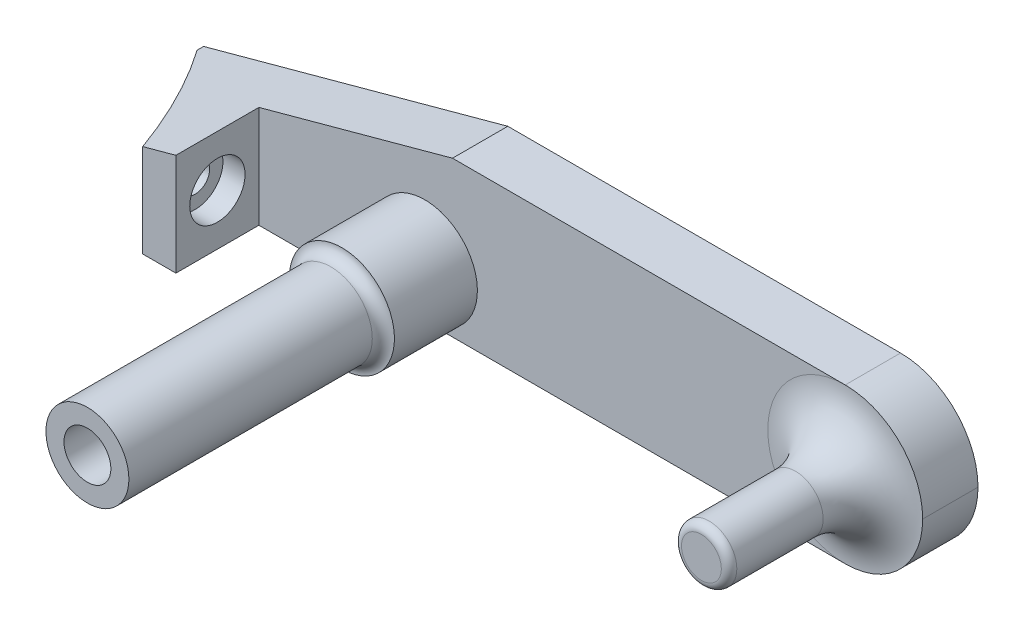
ISO-10303-21;
HEADER;
FILE_DESCRIPTION(('STEP AP214'),'2;1');
FILE_NAME('part.step','',(''),(''),'','','');
FILE_SCHEMA(('AUTOMOTIVE_DESIGN { 1 0 10303 214 1 1 1 1 }'));
ENDSEC;
DATA;
#1=APPLICATION_CONTEXT('core data for automotive mechanical design processes');
#2=APPLICATION_PROTOCOL_DEFINITION('international standard','automotive_design',2000,#1);
#3=PRODUCT_CONTEXT('',#1,'mechanical');
#4=PRODUCT('Part','Part','',(#3));
#5=PRODUCT_RELATED_PRODUCT_CATEGORY('part','',(#4));
#6=PRODUCT_DEFINITION_FORMATION('','',#4);
#7=PRODUCT_DEFINITION_CONTEXT('part definition',#1,'design');
#8=PRODUCT_DEFINITION('design','',#6,#7);
#9=PRODUCT_DEFINITION_SHAPE('','',#8);
#10=(LENGTH_UNIT() NAMED_UNIT(*) SI_UNIT(.MILLI.,.METRE.));
#11=(NAMED_UNIT(*) PLANE_ANGLE_UNIT() SI_UNIT($,.RADIAN.));
#12=(NAMED_UNIT(*) SI_UNIT($,.STERADIAN.) SOLID_ANGLE_UNIT());
#13=UNCERTAINTY_MEASURE_WITH_UNIT(LENGTH_MEASURE(1.E-05),#10,'distance_accuracy_value','');
#14=(GEOMETRIC_REPRESENTATION_CONTEXT(3) GLOBAL_UNCERTAINTY_ASSIGNED_CONTEXT((#13)) GLOBAL_UNIT_ASSIGNED_CONTEXT((#10,
#11,#12)) REPRESENTATION_CONTEXT('',''));
#15=CARTESIAN_POINT('',(0.,0.,0.));
#16=DIRECTION('',(0.,0.,1.));
#17=DIRECTION('',(1.,0.,0.));
#18=AXIS2_PLACEMENT_3D('',#15,#16,#17);
#19=CARTESIAN_POINT('',(0.,0.,-167.64));
#20=DIRECTION('',(-1.,0.,0.));
#21=DIRECTION('',(0.,0.,-1.));
#22=AXIS2_PLACEMENT_3D('',#19,#20,#21);
#23=PLANE('',#22);
#24=DIRECTION('',(0.,0.,-1.));
#25=VECTOR('',#24,1.);
#26=CARTESIAN_POINT('',(0.,16.51,-63.4888605062048));
#27=LINE('',#26,#25);
#28=CARTESIAN_POINT('',(0.,16.51,-166.163728948486));
#29=VERTEX_POINT('',#28);
#30=CARTESIAN_POINT('',(0.,16.51,-167.64));
#31=VERTEX_POINT('',#30);
#32=EDGE_CURVE('E135',#29,#31,#27,.T.);
#33=ORIENTED_EDGE('',*,*,#32,.T.);
#34=DIRECTION('',(0.,1.,0.));
#35=VECTOR('',#34,1.);
#36=CARTESIAN_POINT('',(0.,0.,-167.64));
#37=LINE('',#36,#35);
#38=CARTESIAN_POINT('',(0.,0.,-167.64));
#39=VERTEX_POINT('',#38);
#40=EDGE_CURVE('E120',#39,#31,#37,.T.);
#41=ORIENTED_EDGE('',*,*,#40,.F.);
#42=DIRECTION('',(0.,0.,1.));
#43=VECTOR('',#42,1.);
#44=CARTESIAN_POINT('',(0.,0.,-167.64));
#45=LINE('',#44,#43);
#46=CARTESIAN_POINT('',(0.,0.,-166.163728948486));
#47=VERTEX_POINT('',#46);
#48=EDGE_CURVE('E139',#39,#47,#45,.T.);
#49=ORIENTED_EDGE('',*,*,#48,.T.);
#50=DIRECTION('',(0.,1.,0.));
#51=VECTOR('',#50,1.);
#52=CARTESIAN_POINT('',(0.,-35.1087889914536,-166.163728948486));
#53=LINE('',#52,#51);
#54=EDGE_CURVE('E200',#47,#29,#53,.T.);
#55=ORIENTED_EDGE('',*,*,#54,.T.);
#56=EDGE_LOOP('',(#33,#41,#49,#55));
#57=FACE_BOUND('',#56,.T.);
#58=ADVANCED_FACE('F39',(#57),#23,.T.);
#59=CARTESIAN_POINT('',(0.,0.,-167.64));
#60=DIRECTION('',(0.,-1.,0.));
#61=DIRECTION('',(0.,0.,1.));
#62=AXIS2_PLACEMENT_3D('',#59,#60,#61);
#63=PLANE('',#62);
#64=DIRECTION('',(-1.,0.,0.));
#65=VECTOR('',#64,1.);
#66=CARTESIAN_POINT('',(0.,0.,-154.94));
#67=LINE('',#66,#65);
#68=CARTESIAN_POINT('',(160.02,0.,-154.94));
#69=VERTEX_POINT('',#68);
#70=CARTESIAN_POINT('',(63.5,0.,-154.94));
#71=VERTEX_POINT('',#70);
#72=EDGE_CURVE('E148',#69,#71,#67,.T.);
#73=ORIENTED_EDGE('',*,*,#72,.T.);
#74=CARTESIAN_POINT('',(25.4,0.,-154.94));
#75=VERTEX_POINT('',#74);
#76=EDGE_CURVE('E152',#71,#75,#67,.T.);
#77=ORIENTED_EDGE('',*,*,#76,.T.);
#78=DIRECTION('',(0.,0.,1.));
#79=VECTOR('',#78,1.);
#80=CARTESIAN_POINT('',(25.4,0.,-154.94));
#81=LINE('',#80,#79);
#82=CARTESIAN_POINT('',(25.4,0.,-135.89));
#83=VERTEX_POINT('',#82);
#84=EDGE_CURVE('E197',#75,#83,#81,.T.);
#85=ORIENTED_EDGE('',*,*,#84,.T.);
#86=DIRECTION('',(-1.,0.,0.));
#87=VECTOR('',#86,1.);
#88=CARTESIAN_POINT('',(0.,0.,-135.89));
#89=LINE('',#88,#87);
#90=CARTESIAN_POINT('',(17.7799999999999,0.,-135.89));
#91=VERTEX_POINT('',#90);
#92=EDGE_CURVE('E193',#83,#91,#89,.T.);
#93=ORIENTED_EDGE('',*,*,#92,.T.);
#94=CARTESIAN_POINT('',(-116.35412696253,0.,-77.47));
#95=DIRECTION('',(0.,1.,0.));
#96=DIRECTION('',(0.,0.,1.));
#97=AXIS2_PLACEMENT_3D('',#94,#95,#96);
#98=CIRCLE('',#97,146.304);
#99=EDGE_CURVE('E230',#47,#91,#98,.F.);
#100=ORIENTED_EDGE('',*,*,#99,.F.);
#101=ORIENTED_EDGE('',*,*,#48,.F.);
#102=DIRECTION('',(-1.,0.,0.));
#103=VECTOR('',#102,1.);
#104=CARTESIAN_POINT('',(0.,0.,-167.64));
#105=LINE('',#104,#103);
#106=CARTESIAN_POINT('',(160.02,0.,-167.64));
#107=VERTEX_POINT('',#106);
#108=EDGE_CURVE('E140',#107,#39,#105,.T.);
#109=ORIENTED_EDGE('',*,*,#108,.F.);
#110=DIRECTION('',(0.,0.,1.));
#111=VECTOR('',#110,1.);
#112=CARTESIAN_POINT('',(160.02,0.,-167.64));
#113=LINE('',#112,#111);
#114=EDGE_CURVE('E162',#69,#107,#113,.F.);
#115=ORIENTED_EDGE('',*,*,#114,.F.);
#116=EDGE_LOOP('',(#73,#77,#85,#93,#100,#101,#109,#115));
#117=FACE_BOUND('',#116,.T.);
#118=ADVANCED_FACE('F184',(#117),#63,.T.);
#119=CARTESIAN_POINT('',(0.,35.56,-167.64));
#120=DIRECTION('',(0.,1.,0.));
#121=DIRECTION('',(0.,0.,-1.));
#122=AXIS2_PLACEMENT_3D('',#119,#120,#121);
#123=PLANE('',#122);
#124=DIRECTION('',(1.,0.,0.));
#125=VECTOR('',#124,1.);
#126=CARTESIAN_POINT('',(0.,35.56,-167.64));
#127=LINE('',#126,#125);
#128=CARTESIAN_POINT('',(69.85,35.56,-167.64));
#129=VERTEX_POINT('',#128);
#130=CARTESIAN_POINT('',(160.02,35.56,-167.64));
#131=VERTEX_POINT('',#130);
#132=EDGE_CURVE('E118',#129,#131,#127,.T.);
#133=ORIENTED_EDGE('',*,*,#132,.F.);
#134=DIRECTION('',(0.,0.,-1.));
#135=VECTOR('',#134,1.);
#136=CARTESIAN_POINT('',(69.85,35.56,-63.4888605062048));
#137=LINE('',#136,#135);
#138=CARTESIAN_POINT('',(69.85,35.56,-154.94));
#139=VERTEX_POINT('',#138);
#140=EDGE_CURVE('E128',#139,#129,#137,.T.);
#141=ORIENTED_EDGE('',*,*,#140,.F.);
#142=DIRECTION('',(1.,0.,0.));
#143=VECTOR('',#142,1.);
#144=CARTESIAN_POINT('',(0.,35.56,-154.94));
#145=LINE('',#144,#143);
#146=CARTESIAN_POINT('',(160.02,35.56,-154.94));
#147=VERTEX_POINT('',#146);
#148=EDGE_CURVE('E151',#139,#147,#145,.T.);
#149=ORIENTED_EDGE('',*,*,#148,.T.);
#150=DIRECTION('',(0.,0.,1.));
#151=VECTOR('',#150,1.);
#152=CARTESIAN_POINT('',(160.02,35.56,-167.64));
#153=LINE('',#152,#151);
#154=EDGE_CURVE('E138',#131,#147,#153,.T.);
#155=ORIENTED_EDGE('',*,*,#154,.F.);
#156=EDGE_LOOP('',(#133,#141,#149,#155));
#157=FACE_BOUND('',#156,.T.);
#158=ADVANCED_FACE('F137',(#157),#123,.T.);
#159=CARTESIAN_POINT('',(0.,0.,-167.64));
#160=DIRECTION('',(0.,0.,-1.));
#161=DIRECTION('',(1.,0.,0.));
#162=AXIS2_PLACEMENT_3D('',#159,#160,#161);
#163=PLANE('',#162);
#164=ORIENTED_EDGE('',*,*,#108,.T.);
#165=ORIENTED_EDGE('',*,*,#40,.T.);
#166=DIRECTION('',(0.964763821237732,0.263117405792109,0.));
#167=VECTOR('',#166,1.);
#168=CARTESIAN_POINT('',(69.85,35.56,-167.64));
#169=LINE('',#168,#167);
#170=EDGE_CURVE('E114',#31,#129,#169,.T.);
#171=ORIENTED_EDGE('',*,*,#170,.T.);
#172=ORIENTED_EDGE('',*,*,#132,.T.);
#173=CARTESIAN_POINT('',(160.02,17.78,-167.64));
#174=DIRECTION('',(0.,0.,1.));
#175=DIRECTION('',(1.,0.,0.));
#176=AXIS2_PLACEMENT_3D('',#173,#174,#175);
#177=CIRCLE('',#176,17.78);
#178=CARTESIAN_POINT('',(177.8,17.78,-167.64));
#179=VERTEX_POINT('',#178);
#180=EDGE_CURVE('E54',#179,#131,#177,.T.);
#181=ORIENTED_EDGE('',*,*,#180,.F.);
#182=CARTESIAN_POINT('',(160.02,17.78,-167.64));
#183=DIRECTION('',(0.,0.,1.));
#184=DIRECTION('',(1.,0.,0.));
#185=AXIS2_PLACEMENT_3D('',#182,#183,#184);
#186=CIRCLE('',#185,17.78);
#187=EDGE_CURVE('E166',#107,#179,#186,.T.);
#188=ORIENTED_EDGE('',*,*,#187,.F.);
#189=EDGE_LOOP('',(#164,#165,#171,#172,#181,#188));
#190=FACE_BOUND('',#189,.T.);
#191=ADVANCED_FACE('F116',(#190),#163,.T.);
#192=CARTESIAN_POINT('',(0.,0.,-154.94));
#193=DIRECTION('',(0.,0.,-1.));
#194=DIRECTION('',(1.,0.,0.));
#195=AXIS2_PLACEMENT_3D('',#192,#193,#194);
#196=PLANE('',#195);
#197=ORIENTED_EDGE('',*,*,#148,.F.);
#198=DIRECTION('',(0.964763821237732,0.263117405792109,0.));
#199=VECTOR('',#198,1.);
#200=CARTESIAN_POINT('',(-4.191,15.367,-154.94));
#201=LINE('',#200,#199);
#202=CARTESIAN_POINT('',(25.4,23.4372727272727,-154.94));
#203=VERTEX_POINT('',#202);
#204=EDGE_CURVE('E131',#203,#139,#201,.T.);
#205=ORIENTED_EDGE('',*,*,#204,.F.);
#206=DIRECTION('',(0.,1.,0.));
#207=VECTOR('',#206,1.);
#208=CARTESIAN_POINT('',(25.4,-31.75,-154.94));
#209=LINE('',#208,#207);
#210=EDGE_CURVE('E210',#75,#203,#209,.T.);
#211=ORIENTED_EDGE('',*,*,#210,.F.);
#212=ORIENTED_EDGE('',*,*,#76,.F.);
#213=CARTESIAN_POINT('',(63.5,12.065,-154.94));
#214=DIRECTION('',(0.,0.,1.));
#215=DIRECTION('',(1.,0.,0.));
#216=AXIS2_PLACEMENT_3D('',#213,#214,#215);
#217=CIRCLE('',#216,12.065);
#218=EDGE_CURVE('E191',#71,#71,#217,.T.);
#219=ORIENTED_EDGE('',*,*,#218,.F.);
#220=ORIENTED_EDGE('',*,*,#72,.F.);
#221=CARTESIAN_POINT('',(160.02,17.78,-154.94));
#222=DIRECTION('',(0.,0.,1.));
#223=DIRECTION('',(1.,0.,0.));
#224=AXIS2_PLACEMENT_3D('',#221,#222,#223);
#225=CIRCLE('',#224,17.78);
#226=EDGE_CURVE('E47',#147,#69,#225,.T.);
#227=ORIENTED_EDGE('',*,*,#226,.F.);
#228=EDGE_LOOP('',(#197,#205,#211,#212,#219,#220,#227));
#229=FACE_BOUND('',#228,.T.);
#230=ADVANCED_FACE('F189',(#229),#196,.F.);
#231=CARTESIAN_POINT('',(0.,-31.75,-135.89));
#232=DIRECTION('',(0.,0.,1.));
#233=DIRECTION('',(-1.,0.,0.));
#234=AXIS2_PLACEMENT_3D('',#231,#232,#233);
#235=PLANE('',#234);
#236=DIRECTION('',(0.964763821237732,0.263117405792109,0.));
#237=VECTOR('',#236,1.);
#238=CARTESIAN_POINT('',(69.85,35.56,-135.89));
#239=LINE('',#238,#237);
#240=CARTESIAN_POINT('',(17.7799999999999,21.3590909090909,-135.89));
#241=VERTEX_POINT('',#240);
#242=CARTESIAN_POINT('',(25.4,23.4372727272727,-135.89));
#243=VERTEX_POINT('',#242);
#244=EDGE_CURVE('E124',#241,#243,#239,.T.);
#245=ORIENTED_EDGE('',*,*,#244,.F.);
#246=DIRECTION('',(0.,1.,0.));
#247=VECTOR('',#246,1.);
#248=CARTESIAN_POINT('',(17.7799999999999,-35.1087889914536,-135.89));
#249=LINE('',#248,#247);
#250=EDGE_CURVE('E227',#91,#241,#249,.T.);
#251=ORIENTED_EDGE('',*,*,#250,.F.);
#252=ORIENTED_EDGE('',*,*,#92,.F.);
#253=DIRECTION('',(0.,1.,0.));
#254=VECTOR('',#253,1.);
#255=CARTESIAN_POINT('',(25.4,-31.75,-135.89));
#256=LINE('',#255,#254);
#257=EDGE_CURVE('E206',#83,#243,#256,.T.);
#258=ORIENTED_EDGE('',*,*,#257,.T.);
#259=EDGE_LOOP('',(#245,#251,#252,#258));
#260=FACE_BOUND('',#259,.T.);
#261=ADVANCED_FACE('F225',(#260),#235,.T.);
#262=CARTESIAN_POINT('',(25.4,-31.75,-154.94));
#263=DIRECTION('',(1.,0.,0.));
#264=DIRECTION('',(0.,0.,1.));
#265=AXIS2_PLACEMENT_3D('',#262,#263,#264);
#266=PLANE('',#265);
#267=CARTESIAN_POINT('',(25.4,11.7186363636364,-145.415));
#268=DIRECTION('',(-1.,0.,0.));
#269=DIRECTION('',(0.,0.,1.));
#270=AXIS2_PLACEMENT_3D('',#267,#268,#269);
#271=CIRCLE('',#270,6.35);
#272=CARTESIAN_POINT('',(25.4,11.7186363636364,-139.065));
#273=VERTEX_POINT('',#272);
#274=EDGE_CURVE('E240',#273,#273,#271,.T.);
#275=ORIENTED_EDGE('',*,*,#274,.T.);
#276=EDGE_LOOP('',(#275));
#277=FACE_BOUND('',#276,.T.);
#278=DIRECTION('',(0.,0.,1.));
#279=VECTOR('',#278,1.);
#280=CARTESIAN_POINT('',(25.4,23.4372727272727,-154.94));
#281=LINE('',#280,#279);
#282=EDGE_CURVE('E221',#203,#243,#281,.T.);
#283=ORIENTED_EDGE('',*,*,#282,.T.);
#284=ORIENTED_EDGE('',*,*,#257,.F.);
#285=ORIENTED_EDGE('',*,*,#84,.F.);
#286=ORIENTED_EDGE('',*,*,#210,.T.);
#287=EDGE_LOOP('',(#283,#284,#285,#286));
#288=FACE_BOUND('',#287,.T.);
#289=ADVANCED_FACE('F220',(#277,#288),#266,.T.);
#290=CARTESIAN_POINT('',(63.5,12.065,-101.765026739937));
#291=DIRECTION('',(0.,0.,-1.));
#292=DIRECTION('',(1.,0.,0.));
#293=AXIS2_PLACEMENT_3D('',#290,#291,#292);
#294=CYLINDRICAL_SURFACE('',#293,12.065);
#295=ORIENTED_EDGE('',*,*,#218,.T.);
#296=EDGE_LOOP('',(#295));
#297=FACE_BOUND('',#296,.T.);
#298=CARTESIAN_POINT('',(63.5,12.065,-135.89));
#299=DIRECTION('',(0.,0.,-1.));
#300=DIRECTION('',(-1.,0.,0.));
#301=AXIS2_PLACEMENT_3D('',#298,#299,#300);
#302=CIRCLE('',#301,12.065);
#303=CARTESIAN_POINT('',(51.435,12.065,-135.89));
#304=VERTEX_POINT('',#303);
#305=EDGE_CURVE('E194',#304,#304,#302,.F.);
#306=ORIENTED_EDGE('',*,*,#305,.F.);
#307=EDGE_LOOP('',(#306));
#308=FACE_BOUND('',#307,.T.);
#309=ADVANCED_FACE('F420',(#297,#308),#294,.T.);
#310=CARTESIAN_POINT('',(0.,0.,-77.47));
#311=DIRECTION('',(0.,0.,-1.));
#312=DIRECTION('',(1.,0.,0.));
#313=AXIS2_PLACEMENT_3D('',#310,#311,#312);
#314=PLANE('',#313);
#315=CARTESIAN_POINT('',(63.5,12.065,-77.47));
#316=DIRECTION('',(0.,0.,-1.));
#317=DIRECTION('',(-1.,0.,0.));
#318=AXIS2_PLACEMENT_3D('',#315,#316,#317);
#319=CIRCLE('',#318,5.38);
#320=CARTESIAN_POINT('',(58.12,12.065,-77.47));
#321=VERTEX_POINT('',#320);
#322=EDGE_CURVE('E171',#321,#321,#319,.T.);
#323=ORIENTED_EDGE('',*,*,#322,.T.);
#324=EDGE_LOOP('',(#323));
#325=FACE_BOUND('',#324,.T.);
#326=CARTESIAN_POINT('',(63.5,12.065,-77.47));
#327=DIRECTION('',(0.,0.,1.));
#328=DIRECTION('',(1.,0.,0.));
#329=AXIS2_PLACEMENT_3D('',#326,#327,#328);
#330=CIRCLE('',#329,9.52500000000002);
#331=CARTESIAN_POINT('',(73.025,12.065,-77.47));
#332=VERTEX_POINT('',#331);
#333=EDGE_CURVE('E213',#332,#332,#330,.T.);
#334=ORIENTED_EDGE('',*,*,#333,.T.);
#335=EDGE_LOOP('',(#334));
#336=FACE_BOUND('',#335,.T.);
#337=ADVANCED_FACE('F410',(#325,#336),#314,.F.);
#338=CARTESIAN_POINT('',(63.5,12.065,-77.47));
#339=DIRECTION('',(0.,0.,-1.));
#340=DIRECTION('',(1.,0.,0.));
#341=AXIS2_PLACEMENT_3D('',#338,#339,#340);
#342=CYLINDRICAL_SURFACE('',#341,9.52500000000002);
#343=CARTESIAN_POINT('',(63.5,12.065,-133.35));
#344=DIRECTION('',(0.,0.,-1.));
#345=DIRECTION('',(-1.,0.,0.));
#346=AXIS2_PLACEMENT_3D('',#343,#344,#345);
#347=CIRCLE('',#346,9.52500000000002);
#348=CARTESIAN_POINT('',(53.975,12.065,-133.35));
#349=VERTEX_POINT('',#348);
#350=EDGE_CURVE('E155',#349,#349,#347,.T.);
#351=ORIENTED_EDGE('',*,*,#350,.F.);
#352=EDGE_LOOP('',(#351));
#353=FACE_BOUND('',#352,.T.);
#354=ORIENTED_EDGE('',*,*,#333,.F.);
#355=EDGE_LOOP('',(#354));
#356=FACE_BOUND('',#355,.T.);
#357=ADVANCED_FACE('F400',(#353,#356),#342,.T.);
#358=CARTESIAN_POINT('',(-116.35412696253,-35.1087889914536,-77.47));
#359=DIRECTION('',(0.,1.,0.));
#360=DIRECTION('',(0.,0.,-1.));
#361=AXIS2_PLACEMENT_3D('',#358,#359,#360);
#362=CYLINDRICAL_SURFACE('',#361,146.304);
#363=CARTESIAN_POINT('',(14.8942748067872,11.7186363636364,-142.113));
#364=CARTESIAN_POINT('',(14.8942690407822,11.5473788315367,-142.113012449861));
#365=CARTESIAN_POINT('',(14.8876795576114,11.3759501279091,-142.126396076546));
#366=CARTESIAN_POINT('',(14.8615724078223,11.0380539648073,-142.179361627576));
#367=CARTESIAN_POINT('',(14.8420352164632,10.8715943954156,-142.218983117733));
#368=CARTESIAN_POINT('',(14.7908922032795,10.5488839891988,-142.322506977017));
#369=CARTESIAN_POINT('',(14.7593180619673,10.3926076044601,-142.386345605968));
#370=CARTESIAN_POINT('',(14.6852853593264,10.093667841519,-142.535657183468));
#371=CARTESIAN_POINT('',(14.6428282990535,9.95100258968547,-142.621127148438));
#372=CARTESIAN_POINT('',(14.5465393648489,9.67676757050316,-142.814380379223));
#373=CARTESIAN_POINT('',(14.4923217719496,9.5458661074265,-142.922916821365));
#374=CARTESIAN_POINT('',(14.375282753341,9.30408514774659,-143.1563676817));
#375=CARTESIAN_POINT('',(14.3124582752066,9.19321278693916,-143.281287909715));
#376=CARTESIAN_POINT('',(14.1733661095346,8.98312839292825,-143.556761035396));
#377=CARTESIAN_POINT('',(14.0963848096591,8.88611072062436,-143.708625727855));
#378=CARTESIAN_POINT('',(13.9360925570785,8.71891094589459,-144.023364653543));
#379=CARTESIAN_POINT('',(13.8527787886049,8.64874086607306,-144.18624378081));
#380=CARTESIAN_POINT('',(13.6727509573464,8.5297314482674,-144.536490047346));
#381=CARTESIAN_POINT('',(13.5755484912748,8.48390628474025,-144.72463246412));
#382=CARTESIAN_POINT('',(13.3782044161099,8.42564682899659,-145.104521554306));
#383=CARTESIAN_POINT('',(13.2780615909343,8.41322655486008,-145.296269706856));
#384=CARTESIAN_POINT('',(13.0695169067604,8.42196124171276,-145.693418316348));
#385=CARTESIAN_POINT('',(12.9610687521201,8.44575467749068,-145.898742216761));
#386=CARTESIAN_POINT('',(12.7465488498493,8.53147105434783,-146.302610708876));
#387=CARTESIAN_POINT('',(12.6404778023398,8.59340507977081,-146.5011533121));
#388=CARTESIAN_POINT('',(12.4329006466577,8.75573705884152,-146.88765194368));
#389=CARTESIAN_POINT('',(12.3314500785011,8.85650946195093,-147.075483812313));
#390=CARTESIAN_POINT('',(12.186615324068,9.03536215270346,-147.342372039813));
#391=CARTESIAN_POINT('',(12.1395367712194,9.09963828765708,-147.428901586999));
#392=CARTESIAN_POINT('',(12.0483425726993,9.23719748688054,-147.596138212037));
#393=CARTESIAN_POINT('',(12.0042251769663,9.31047515740104,-147.676848731097));
#394=CARTESIAN_POINT('',(11.9227031710155,9.45985600819508,-147.825681572044));
#395=CARTESIAN_POINT('',(11.8850432447379,9.53533228141587,-147.89429410646));
#396=CARTESIAN_POINT('',(11.8132270671309,9.69328062478828,-148.024910007988));
#397=CARTESIAN_POINT('',(11.7790688109334,9.7757486418631,-148.086917157793));
#398=CARTESIAN_POINT('',(11.7147421465945,9.94715502786404,-148.203511260459));
#399=CARTESIAN_POINT('',(11.6845712243429,10.0360892643097,-148.258102889594));
#400=CARTESIAN_POINT('',(11.6286820413407,10.2198141157597,-148.359098945357));
#401=CARTESIAN_POINT('',(11.602963013268,10.3146037177127,-148.405504782902));
#402=CARTESIAN_POINT('',(11.5595001462576,10.4963993157231,-148.483844782715));
#403=CARTESIAN_POINT('',(11.5411521887806,10.5827880123479,-148.516879735504));
#404=CARTESIAN_POINT('',(11.5084313222673,10.7587080557126,-148.575750398485));
#405=CARTESIAN_POINT('',(11.4940578020599,10.8482389168757,-148.601587215578));
#406=CARTESIAN_POINT('',(11.4695221230705,11.0296606656458,-148.645668538189));
#407=CARTESIAN_POINT('',(11.4593571404659,11.1215499267193,-148.663918134575));
#408=CARTESIAN_POINT('',(11.4433925967408,11.3068861956917,-148.692571327756));
#409=CARTESIAN_POINT('',(11.4375926516445,11.4003330658342,-148.702975614674));
#410=CARTESIAN_POINT('',(11.4277023422093,11.6610361662409,-148.720717737081));
#411=CARTESIAN_POINT('',(11.428448995379,11.8291785231343,-148.719378872958));
#412=CARTESIAN_POINT('',(11.4440973881043,12.1625277852785,-148.691306455051));
#413=CARTESIAN_POINT('',(11.4589963026932,12.3277352696618,-148.664577969349));
#414=CARTESIAN_POINT('',(11.5015493572826,12.6463098421829,-148.588129072857));
#415=CARTESIAN_POINT('',(11.5288574189326,12.7998741325392,-148.539032397046));
#416=CARTESIAN_POINT('',(11.5948290857396,13.0961446158955,-148.420191372091));
#417=CARTESIAN_POINT('',(11.633494739632,13.2388488440543,-148.350443297733));
#418=CARTESIAN_POINT('',(11.7232270924922,13.5187452674577,-148.188179152057));
#419=CARTESIAN_POINT('',(11.7748977370645,13.655095687401,-148.094549802096));
#420=CARTESIAN_POINT('',(11.8872670394066,13.9101697821184,-147.890301499904));
#421=CARTESIAN_POINT('',(11.947969327335,14.0288863306543,-147.77967571558));
#422=CARTESIAN_POINT('',(12.0837278382801,14.2594772935604,-147.531401765036));
#423=CARTESIAN_POINT('',(12.1596304697527,14.3690863672901,-147.39211413216));
#424=CARTESIAN_POINT('',(12.3178658346708,14.5634651215008,-147.100497964254));
#425=CARTESIAN_POINT('',(12.4002016551697,14.6482227828251,-146.94816316495));
#426=CARTESIAN_POINT('',(12.5793447847258,14.8008643876912,-146.615210216636));
#427=CARTESIAN_POINT('',(12.676702011131,14.8654957778231,-146.433393292413));
#428=CARTESIAN_POINT('',(12.8741469846111,14.9621576799262,-146.062694986527));
#429=CARTESIAN_POINT('',(12.9742359591216,14.9941732807789,-145.873810414588));
#430=CARTESIAN_POINT('',(13.1828379726136,15.0264691491857,-145.478007201765));
#431=CARTESIAN_POINT('',(13.2913761976852,15.0239665301132,-145.270867846263));
#432=CARTESIAN_POINT('',(13.5057851283263,14.9801204246821,-144.859298657834));
#433=CARTESIAN_POINT('',(13.6116552244035,14.9387681448431,-144.654869448963));
#434=CARTESIAN_POINT('',(13.8184338836313,14.8166990047129,-144.25335121655));
#435=CARTESIAN_POINT('',(13.9193057420517,14.7357281335628,-144.056318512565));
#436=CARTESIAN_POINT('',(14.0636722408308,14.5853554905835,-143.772861658302));
#437=CARTESIAN_POINT('',(14.1106592531346,14.5303771975844,-143.680348233585));
#438=CARTESIAN_POINT('',(14.2019049787216,14.4109519182068,-143.500243691691));
#439=CARTESIAN_POINT('',(14.2461652288174,14.3465103359717,-143.412649804352));
#440=CARTESIAN_POINT('',(14.3284524867397,14.2133792057985,-143.24941628438));
#441=CARTESIAN_POINT('',(14.366698899737,14.1453231326698,-143.173369737329));
#442=CARTESIAN_POINT('',(14.4400615801379,14.0016473251573,-143.027206616705));
#443=CARTESIAN_POINT('',(14.4751795293464,13.9260317016194,-142.95708685805));
#444=CARTESIAN_POINT('',(14.5419221685955,13.7676529526712,-142.823579175193));
#445=CARTESIAN_POINT('',(14.5735470974394,13.6848903165629,-142.760190790806));
#446=CARTESIAN_POINT('',(14.6329254897776,13.5127886451058,-142.640982360445));
#447=CARTESIAN_POINT('',(14.6606795704987,13.4234506617092,-142.585161107892));
#448=CARTESIAN_POINT('',(14.7090509375592,13.2493689338375,-142.487739349873));
#449=CARTESIAN_POINT('',(14.7301204834769,13.1652503215842,-142.445244322132));
#450=CARTESIAN_POINT('',(14.7686971907938,12.9930077542867,-142.3673596685));
#451=CARTESIAN_POINT('',(14.7862048883134,12.904884404472,-142.331968973293));
#452=CARTESIAN_POINT('',(14.8174199216641,12.725498807154,-142.268819002455));
#453=CARTESIAN_POINT('',(14.8311350062135,12.6342433943571,-142.241044167791));
#454=CARTESIAN_POINT('',(14.8546358469364,12.4492357088037,-142.193424535302));
#455=CARTESIAN_POINT('',(14.864423489505,12.3554846578603,-142.173575930441));
#456=CARTESIAN_POINT('',(14.8795199027076,12.1715204413759,-142.142951260195));
#457=CARTESIAN_POINT('',(14.885046662258,12.0813988107553,-142.13173369867));
#458=CARTESIAN_POINT('',(14.892425610862,11.9004129777575,-142.11675483281));
#459=CARTESIAN_POINT('',(14.8942778676832,11.8095487891061,-142.112993390965));
#460=CARTESIAN_POINT('',(14.8942748067872,11.7186363636364,-142.113));
#461=B_SPLINE_CURVE_WITH_KNOTS('',3,(#363,#364,#365,#366,#367,#368,#369,#370,#371,#372,#373,
#374,#375,#376,#377,#378,#379,#380,#381,#382,#383,#384,#385,#386,#387,#388,#389,#390,#391,#392,
#393,#394,#395,#396,#397,#398,#399,#400,#401,#402,#403,#404,#405,#406,#407,#408,#409,#410,#411,
#412,#413,#414,#415,#416,#417,#418,#419,#420,#421,#422,#423,#424,#425,#426,#427,#428,#429,#430,
#431,#432,#433,#434,#435,#436,#437,#438,#439,#440,#441,#442,#443,#444,#445,#446,#447,#448,#449,
#450,#451,#452,#453,#454,#455,#456,#457,#458,#459,#460),.UNSPECIFIED.,.T.,.F.,(4,2,2,2,2,2,2,2,
2,2,2,2,2,2,2,2,2,2,2,2,2,2,2,2,2,2,2,2,2,2,2,2,2,2,2,2,2,2,2,2,2,2,2,2,2,2,2,2,4),(0.,
0.513433112513829,1.02764223328503,1.54050722769665,2.05330152186298,2.58652139099459,
3.1199308580515,3.70540380274741,4.29113862172589,4.93838893654837,5.58591082215653,
6.2829185337642,6.98012890404865,7.68423654047961,8.03667740730399,8.38890811121533,
8.71465003439496,9.04020440121092,9.36555250872176,9.69084448375086,9.97332798635856,
10.2557680257341,10.5380182466243,10.8202436361245,11.3219443878768,11.8235450149846,
12.3119420425272,12.8004272235573,13.3181635982123,13.8361086356658,14.4122158114438,
14.988601158284,15.6342641623232,16.2802222149583,16.9785425867709,17.6770210589702,
18.3800376303733,18.7318975121234,19.0835572351817,19.4100653540188,19.7363968752977,
20.0627060728112,20.3889631789878,20.6782795978352,20.9675524372264,21.2562298192367,
21.5447683797676,21.8173304672986,22.0898875280177),.UNSPECIFIED.);
#462=CARTESIAN_POINT('',(14.8942748067872,11.7186363636364,-142.113));
#463=VERTEX_POINT('',#462);
#464=EDGE_CURVE('E248',#463,#463,#461,.T.);
#465=ORIENTED_EDGE('',*,*,#464,.T.);
#466=EDGE_LOOP('',(#465));
#467=FACE_BOUND('',#466,.T.);
#468=ORIENTED_EDGE('',*,*,#54,.F.);
#469=ORIENTED_EDGE('',*,*,#99,.T.);
#470=ORIENTED_EDGE('',*,*,#250,.T.);
#471=CARTESIAN_POINT('',(-116.35412696253,-15.2229437170535,-77.47));
#472=DIRECTION('',(-0.263117405792109,0.964763821237732,0.));
#473=DIRECTION('',(0.964763821237732,0.263117405792109,0.));
#474=AXIS2_PLACEMENT_3D('',#471,#472,#473);
#475=ELLIPSE('',#474,151.64747763064,146.304);
#476=EDGE_CURVE('E143',#29,#241,#475,.F.);
#477=ORIENTED_EDGE('',*,*,#476,.F.);
#478=EDGE_LOOP('',(#468,#469,#470,#477));
#479=FACE_BOUND('',#478,.T.);
#480=ADVANCED_FACE('F232',(#467,#479),#362,.F.);
#481=CARTESIAN_POINT('',(69.85,35.56,-63.4888605062048));
#482=DIRECTION('',(0.263117405792109,-0.964763821237732,0.));
#483=DIRECTION('',(0.964763821237732,0.263117405792109,0.));
#484=AXIS2_PLACEMENT_3D('',#481,#482,#483);
#485=PLANE('',#484);
#486=ORIENTED_EDGE('',*,*,#282,.F.);
#487=ORIENTED_EDGE('',*,*,#204,.T.);
#488=ORIENTED_EDGE('',*,*,#140,.T.);
#489=ORIENTED_EDGE('',*,*,#170,.F.);
#490=ORIENTED_EDGE('',*,*,#32,.F.);
#491=ORIENTED_EDGE('',*,*,#476,.T.);
#492=ORIENTED_EDGE('',*,*,#244,.T.);
#493=EDGE_LOOP('',(#486,#487,#488,#489,#490,#491,#492));
#494=FACE_BOUND('',#493,.T.);
#495=ADVANCED_FACE('F129',(#494),#485,.F.);
#496=CARTESIAN_POINT('',(20.32,11.7186363636364,-145.415));
#497=DIRECTION('',(1.,0.,0.));
#498=DIRECTION('',(0.,0.,1.));
#499=AXIS2_PLACEMENT_3D('',#496,#497,#498);
#500=CYLINDRICAL_SURFACE('',#499,6.35);
#501=CARTESIAN_POINT('',(20.32,11.7186363636364,-145.415));
#502=DIRECTION('',(-1.,0.,0.));
#503=DIRECTION('',(0.,0.,1.));
#504=AXIS2_PLACEMENT_3D('',#501,#502,#503);
#505=CIRCLE('',#504,6.35);
#506=CARTESIAN_POINT('',(20.32,11.7186363636364,-139.065));
#507=VERTEX_POINT('',#506);
#508=EDGE_CURVE('E125',#507,#507,#505,.T.);
#509=ORIENTED_EDGE('',*,*,#508,.T.);
#510=EDGE_LOOP('',(#509));
#511=FACE_BOUND('',#510,.T.);
#512=ORIENTED_EDGE('',*,*,#274,.F.);
#513=EDGE_LOOP('',(#512));
#514=FACE_BOUND('',#513,.T.);
#515=ADVANCED_FACE('F374',(#511,#514),#500,.F.);
#516=CARTESIAN_POINT('',(20.32,11.7186363636364,-145.415));
#517=DIRECTION('',(1.,0.,0.));
#518=DIRECTION('',(0.,0.,1.));
#519=AXIS2_PLACEMENT_3D('',#516,#517,#518);
#520=PLANE('',#519);
#521=CARTESIAN_POINT('',(20.32,11.7186363636364,-145.415));
#522=DIRECTION('',(-1.,0.,0.));
#523=DIRECTION('',(0.,0.,1.));
#524=AXIS2_PLACEMENT_3D('',#521,#522,#523);
#525=CIRCLE('',#524,3.302);
#526=CARTESIAN_POINT('',(20.32,11.7186363636364,-142.113));
#527=VERTEX_POINT('',#526);
#528=EDGE_CURVE('E243',#527,#527,#525,.T.);
#529=ORIENTED_EDGE('',*,*,#528,.T.);
#530=EDGE_LOOP('',(#529));
#531=FACE_BOUND('',#530,.T.);
#532=ORIENTED_EDGE('',*,*,#508,.F.);
#533=EDGE_LOOP('',(#532));
#534=FACE_BOUND('',#533,.T.);
#535=ADVANCED_FACE('F265',(#531,#534),#520,.T.);
#536=CARTESIAN_POINT('',(-0.00100000000001141,11.7186363636364,-145.415));
#537=DIRECTION('',(1.,0.,0.));
#538=DIRECTION('',(0.,0.,1.));
#539=AXIS2_PLACEMENT_3D('',#536,#537,#538);
#540=CYLINDRICAL_SURFACE('',#539,3.302);
#541=ORIENTED_EDGE('',*,*,#528,.F.);
#542=EDGE_LOOP('',(#541));
#543=FACE_BOUND('',#542,.T.);
#544=ORIENTED_EDGE('',*,*,#464,.F.);
#545=EDGE_LOOP('',(#544));
#546=FACE_BOUND('',#545,.T.);
#547=ADVANCED_FACE('F260',(#543,#546),#540,.F.);
#548=CARTESIAN_POINT('',(63.5,12.065,-87.93));
#549=DIRECTION('',(0.,0.,1.));
#550=DIRECTION('',(-1.,0.,0.));
#551=AXIS2_PLACEMENT_3D('',#548,#549,#550);
#552=CYLINDRICAL_SURFACE('',#551,5.38);
#553=CARTESIAN_POINT('',(63.5,12.065,-87.93));
#554=DIRECTION('',(0.,0.,-1.));
#555=DIRECTION('',(-1.,0.,0.));
#556=AXIS2_PLACEMENT_3D('',#553,#554,#555);
#557=CIRCLE('',#556,5.38);
#558=CARTESIAN_POINT('',(58.12,12.065,-87.93));
#559=VERTEX_POINT('',#558);
#560=EDGE_CURVE('E256',#559,#559,#557,.T.);
#561=CARTESIAN_POINT('',(58.12,12.065,-87.93));
#562=CARTESIAN_POINT('',(58.12,12.065,-87.8210416666667));
#563=CARTESIAN_POINT('',(58.12,12.065,-87.7120833333333));
#564=CARTESIAN_POINT('',(58.12,12.065,-87.4941666666666));
#565=CARTESIAN_POINT('',(58.12,12.065,-87.3852083333333));
#566=CARTESIAN_POINT('',(58.12,12.065,-87.1672916666666));
#567=CARTESIAN_POINT('',(58.12,12.065,-87.0583333333333));
#568=CARTESIAN_POINT('',(58.12,12.065,-86.8404166666667));
#569=CARTESIAN_POINT('',(58.12,12.065,-86.7314583333333));
#570=CARTESIAN_POINT('',(58.12,12.065,-86.5135416666667));
#571=CARTESIAN_POINT('',(58.12,12.065,-86.4045833333333));
#572=CARTESIAN_POINT('',(58.12,12.065,-86.1866666666667));
#573=CARTESIAN_POINT('',(58.12,12.065,-86.0777083333333));
#574=CARTESIAN_POINT('',(58.12,12.065,-85.8597916666667));
#575=CARTESIAN_POINT('',(58.12,12.065,-85.7508333333333));
#576=CARTESIAN_POINT('',(58.12,12.065,-85.5329166666667));
#577=CARTESIAN_POINT('',(58.12,12.065,-85.4239583333333));
#578=CARTESIAN_POINT('',(58.12,12.065,-85.2060416666666));
#579=CARTESIAN_POINT('',(58.12,12.065,-85.0970833333333));
#580=CARTESIAN_POINT('',(58.12,12.065,-84.8791666666667));
#581=CARTESIAN_POINT('',(58.12,12.065,-84.7702083333333));
#582=CARTESIAN_POINT('',(58.12,12.065,-84.5522916666666));
#583=CARTESIAN_POINT('',(58.12,12.065,-84.4433333333333));
#584=CARTESIAN_POINT('',(58.12,12.065,-84.2254166666666));
#585=CARTESIAN_POINT('',(58.12,12.065,-84.1164583333333));
#586=CARTESIAN_POINT('',(58.12,12.065,-83.8985416666667));
#587=CARTESIAN_POINT('',(58.12,12.065,-83.7895833333333));
#588=CARTESIAN_POINT('',(58.12,12.065,-83.5716666666667));
#589=CARTESIAN_POINT('',(58.12,12.065,-83.4627083333333));
#590=CARTESIAN_POINT('',(58.12,12.065,-83.2447916666667));
#591=CARTESIAN_POINT('',(58.12,12.065,-83.1358333333333));
#592=CARTESIAN_POINT('',(58.12,12.065,-82.9179166666667));
#593=CARTESIAN_POINT('',(58.12,12.065,-82.8089583333333));
#594=CARTESIAN_POINT('',(58.12,12.065,-82.5910416666667));
#595=CARTESIAN_POINT('',(58.12,12.065,-82.4820833333333));
#596=CARTESIAN_POINT('',(58.12,12.065,-82.2641666666667));
#597=CARTESIAN_POINT('',(58.12,12.065,-82.1552083333333));
#598=CARTESIAN_POINT('',(58.12,12.065,-81.9372916666667));
#599=CARTESIAN_POINT('',(58.12,12.065,-81.8283333333333));
#600=CARTESIAN_POINT('',(58.12,12.065,-81.6104166666667));
#601=CARTESIAN_POINT('',(58.12,12.065,-81.5014583333333));
#602=CARTESIAN_POINT('',(58.12,12.065,-81.2835416666667));
#603=CARTESIAN_POINT('',(58.12,12.065,-81.1745833333333));
#604=CARTESIAN_POINT('',(58.12,12.065,-80.9566666666666));
#605=CARTESIAN_POINT('',(58.12,12.065,-80.8477083333333));
#606=CARTESIAN_POINT('',(58.12,12.065,-80.6297916666667));
#607=CARTESIAN_POINT('',(58.12,12.065,-80.5208333333333));
#608=CARTESIAN_POINT('',(58.12,12.065,-80.3029166666667));
#609=CARTESIAN_POINT('',(58.12,12.065,-80.1939583333333));
#610=CARTESIAN_POINT('',(58.12,12.065,-79.9760416666666));
#611=CARTESIAN_POINT('',(58.12,12.065,-79.8670833333333));
#612=CARTESIAN_POINT('',(58.12,12.065,-79.6491666666667));
#613=CARTESIAN_POINT('',(58.12,12.065,-79.5402083333333));
#614=CARTESIAN_POINT('',(58.12,12.065,-79.3222916666667));
#615=CARTESIAN_POINT('',(58.12,12.065,-79.2133333333333));
#616=CARTESIAN_POINT('',(58.12,12.065,-78.9954166666667));
#617=CARTESIAN_POINT('',(58.12,12.065,-78.8864583333333));
#618=CARTESIAN_POINT('',(58.12,12.065,-78.6685416666667));
#619=CARTESIAN_POINT('',(58.12,12.065,-78.5595833333333));
#620=CARTESIAN_POINT('',(58.12,12.065,-78.3416666666667));
#621=CARTESIAN_POINT('',(58.12,12.065,-78.2327083333333));
#622=CARTESIAN_POINT('',(58.12,12.065,-78.0147916666667));
#623=CARTESIAN_POINT('',(58.12,12.065,-77.9058333333333));
#624=CARTESIAN_POINT('',(58.12,12.065,-77.6879166666667));
#625=CARTESIAN_POINT('',(58.12,12.065,-77.5789583333333));
#626=CARTESIAN_POINT('',(58.12,12.065,-77.47));
#627=B_SPLINE_CURVE_WITH_KNOTS('',3,(#561,#562,#563,#564,#565,#566,#567,#568,#569,#570,#571,
#572,#573,#574,#575,#576,#577,#578,#579,#580,#581,#582,#583,#584,#585,#586,#587,#588,#589,#590,
#591,#592,#593,#594,#595,#596,#597,#598,#599,#600,#601,#602,#603,#604,#605,#606,#607,#608,#609,
#610,#611,#612,#613,#614,#615,#616,#617,#618,#619,#620,#621,#622,#623,#624,#625,#626),
.UNSPECIFIED.,.F.,.F.,(4,2,2,2,2,2,2,2,2,2,2,2,2,2,2,2,2,2,2,2,2,2,2,2,2,2,2,2,2,2,2,2,4),(0.,
0.32687499999999,0.653749999999995,0.980624999999999,1.30749999999999,1.63437499999999,1.96125,
2.28812499999999,2.61499999999999,2.941875,3.26874999999999,3.59562499999999,3.9225,
4.24937499999999,4.57624999999999,4.90312499999999,5.22999999999998,5.55687499999999,
5.88374999999999,6.210625,6.53749999999999,6.86437499999999,7.19125,7.51812499999999,
7.84499999999999,8.17187499999999,8.49874999999999,8.82562499999999,9.15249999999999,
9.47937499999999,9.80624999999999,10.133125,10.46),.UNSPECIFIED.);
#628=EDGE_CURVE('BSEAM264',#559,#321,#627,.T.);
#629=ORIENTED_EDGE('',*,*,#560,.T.);
#630=ORIENTED_EDGE('',*,*,#322,.F.);
#631=ORIENTED_EDGE('',*,*,#628,.T.);
#632=ORIENTED_EDGE('',*,*,#628,.F.);
#633=EDGE_LOOP('',(#629,#631,#630,#632));
#634=FACE_BOUND('',#633,.T.);
#635=ADVANCED_FACE('F264',(#634),#552,.F.);
#636=CARTESIAN_POINT('',(0.,0.,-87.93));
#637=DIRECTION('',(0.,0.,1.));
#638=DIRECTION('',(-1.,0.,0.));
#639=AXIS2_PLACEMENT_3D('',#636,#637,#638);
#640=PLANE('',#639);
#641=ORIENTED_EDGE('',*,*,#560,.F.);
#642=EDGE_LOOP('',(#641));
#643=FACE_BOUND('',#642,.T.);
#644=ADVANCED_FACE('F269',(#643),#640,.T.);
#645=CARTESIAN_POINT('',(160.02,17.78,-121.92));
#646=DIRECTION('',(0.,0.,-1.));
#647=DIRECTION('',(1.,0.,0.));
#648=AXIS2_PLACEMENT_3D('',#645,#646,#647);
#649=CYLINDRICAL_SURFACE('',#648,6.35);
#650=CARTESIAN_POINT('',(160.02,17.78,-143.51));
#651=DIRECTION('',(0.,0.,1.));
#652=DIRECTION('',(1.,0.,0.));
#653=AXIS2_PLACEMENT_3D('',#650,#651,#652);
#654=CIRCLE('',#653,6.35);
#655=CARTESIAN_POINT('',(166.37,17.78,-143.51));
#656=VERTEX_POINT('',#655);
#657=EDGE_CURVE('E11',#656,#656,#654,.F.);
#658=ORIENTED_EDGE('',*,*,#657,.F.);
#659=EDGE_LOOP('',(#658));
#660=FACE_BOUND('',#659,.T.);
#661=CARTESIAN_POINT('',(160.02,17.78,-123.698));
#662=DIRECTION('',(0.,0.,1.));
#663=DIRECTION('',(1.,0.,0.));
#664=AXIS2_PLACEMENT_3D('',#661,#662,#663);
#665=CIRCLE('',#664,6.35);
#666=CARTESIAN_POINT('',(166.37,17.78,-123.698));
#667=VERTEX_POINT('',#666);
#668=EDGE_CURVE('E169',#667,#667,#665,.T.);
#669=ORIENTED_EDGE('',*,*,#668,.F.);
#670=EDGE_LOOP('',(#669));
#671=FACE_BOUND('',#670,.T.);
#672=ADVANCED_FACE('F273',(#660,#671),#649,.T.);
#673=CARTESIAN_POINT('',(0.,0.,-121.92));
#674=DIRECTION('',(0.,0.,-1.));
#675=DIRECTION('',(1.,0.,0.));
#676=AXIS2_PLACEMENT_3D('',#673,#674,#675);
#677=PLANE('',#676);
#678=CARTESIAN_POINT('',(160.02,17.78,-121.92));
#679=DIRECTION('',(0.,0.,1.));
#680=DIRECTION('',(1.,0.,0.));
#681=AXIS2_PLACEMENT_3D('',#678,#679,#680);
#682=CIRCLE('',#681,4.572);
#683=CARTESIAN_POINT('',(164.592,17.78,-121.92));
#684=VERTEX_POINT('',#683);
#685=EDGE_CURVE('E174',#684,#684,#682,.F.);
#686=ORIENTED_EDGE('',*,*,#685,.F.);
#687=EDGE_LOOP('',(#686));
#688=FACE_BOUND('',#687,.T.);
#689=ADVANCED_FACE('F277',(#688),#677,.F.);
#690=CARTESIAN_POINT('',(63.5,12.065,-133.35));
#691=DIRECTION('',(0.,0.,1.));
#692=DIRECTION('',(-1.,0.,0.));
#693=AXIS2_PLACEMENT_3D('',#690,#691,#692);
#694=TOROIDAL_SURFACE('',#693,12.065,2.54);
#695=ORIENTED_EDGE('',*,*,#350,.T.);
#696=EDGE_LOOP('',(#695));
#697=FACE_BOUND('',#696,.T.);
#698=ORIENTED_EDGE('',*,*,#305,.T.);
#699=EDGE_LOOP('',(#698));
#700=FACE_BOUND('',#699,.T.);
#701=ADVANCED_FACE('F280',(#697,#700),#694,.F.);
#702=CARTESIAN_POINT('',(160.02,17.78,-167.64));
#703=DIRECTION('',(0.,0.,1.));
#704=DIRECTION('',(-1.,0.,0.));
#705=AXIS2_PLACEMENT_3D('',#702,#703,#704);
#706=CYLINDRICAL_SURFACE('',#705,17.78);
#707=ORIENTED_EDGE('',*,*,#154,.T.);
#708=CARTESIAN_POINT('',(160.02,17.78,-154.94));
#709=DIRECTION('',(0.,0.,1.));
#710=DIRECTION('',(1.,0.,0.));
#711=AXIS2_PLACEMENT_3D('',#708,#709,#710);
#712=CIRCLE('',#711,17.78);
#713=CARTESIAN_POINT('',(177.8,17.78,-154.94));
#714=VERTEX_POINT('',#713);
#715=EDGE_CURVE('E158',#147,#714,#712,.F.);
#716=ORIENTED_EDGE('',*,*,#715,.T.);
#717=DIRECTION('',(0.,0.,1.));
#718=VECTOR('',#717,1.);
#719=CARTESIAN_POINT('',(177.8,17.78,-167.64));
#720=LINE('',#719,#718);
#721=EDGE_CURVE('E59',#714,#179,#720,.F.);
#722=ORIENTED_EDGE('',*,*,#721,.T.);
#723=ORIENTED_EDGE('',*,*,#180,.T.);
#724=EDGE_LOOP('',(#707,#716,#722,#723));
#725=FACE_BOUND('',#724,.T.);
#726=ADVANCED_FACE('F285',(#725),#706,.T.);
#727=CARTESIAN_POINT('',(160.02,17.78,-167.64));
#728=DIRECTION('',(0.,0.,1.));
#729=DIRECTION('',(-1.,0.,0.));
#730=AXIS2_PLACEMENT_3D('',#727,#728,#729);
#731=CYLINDRICAL_SURFACE('',#730,17.78);
#732=ORIENTED_EDGE('',*,*,#187,.T.);
#733=ORIENTED_EDGE('',*,*,#721,.F.);
#734=CARTESIAN_POINT('',(160.02,17.78,-154.94));
#735=DIRECTION('',(0.,0.,1.));
#736=DIRECTION('',(1.,0.,0.));
#737=AXIS2_PLACEMENT_3D('',#734,#735,#736);
#738=CIRCLE('',#737,17.78);
#739=EDGE_CURVE('E160',#714,#69,#738,.F.);
#740=ORIENTED_EDGE('',*,*,#739,.T.);
#741=ORIENTED_EDGE('',*,*,#114,.T.);
#742=EDGE_LOOP('',(#732,#733,#740,#741));
#743=FACE_BOUND('',#742,.T.);
#744=ADVANCED_FACE('F298',(#743),#731,.T.);
#745=CARTESIAN_POINT('',(160.02,17.78,-123.698));
#746=DIRECTION('',(0.,0.,-1.));
#747=DIRECTION('',(1.,0.,0.));
#748=AXIS2_PLACEMENT_3D('',#745,#746,#747);
#749=TOROIDAL_SURFACE('',#748,4.572,1.778);
#750=ORIENTED_EDGE('',*,*,#685,.T.);
#751=EDGE_LOOP('',(#750));
#752=FACE_BOUND('',#751,.T.);
#753=ORIENTED_EDGE('',*,*,#668,.T.);
#754=EDGE_LOOP('',(#753));
#755=FACE_BOUND('',#754,.T.);
#756=ADVANCED_FACE('F301',(#752,#755),#749,.T.);
#757=CARTESIAN_POINT('',(160.02,17.78,-143.51));
#758=DIRECTION('',(0.,0.,-1.));
#759=DIRECTION('',(1.,0.,0.));
#760=AXIS2_PLACEMENT_3D('',#757,#758,#759);
#761=TOROIDAL_SURFACE('',#760,17.78,11.43);
#762=ORIENTED_EDGE('',*,*,#657,.T.);
#763=EDGE_LOOP('',(#762));
#764=FACE_BOUND('',#763,.T.);
#765=ORIENTED_EDGE('',*,*,#226,.T.);
#766=ORIENTED_EDGE('',*,*,#739,.F.);
#767=ORIENTED_EDGE('',*,*,#715,.F.);
#768=EDGE_LOOP('',(#765,#766,#767));
#769=FACE_BOUND('',#768,.T.);
#770=ADVANCED_FACE('F41',(#764,#769),#761,.F.);
#771=CLOSED_SHELL('',(#58,#118,#158,#191,#230,#261,#289,#309,#337,#357,#480,#495,#515,#535,#547,
#635,#644,#672,#689,#701,#726,#744,#756,#770));
#772=MANIFOLD_SOLID_BREP('B2',#771);
#773=ADVANCED_BREP_SHAPE_REPRESENTATION('',(#18,#772),#14);
#774=SHAPE_DEFINITION_REPRESENTATION(#9,#773);
ENDSEC;
END-ISO-10303-21;
